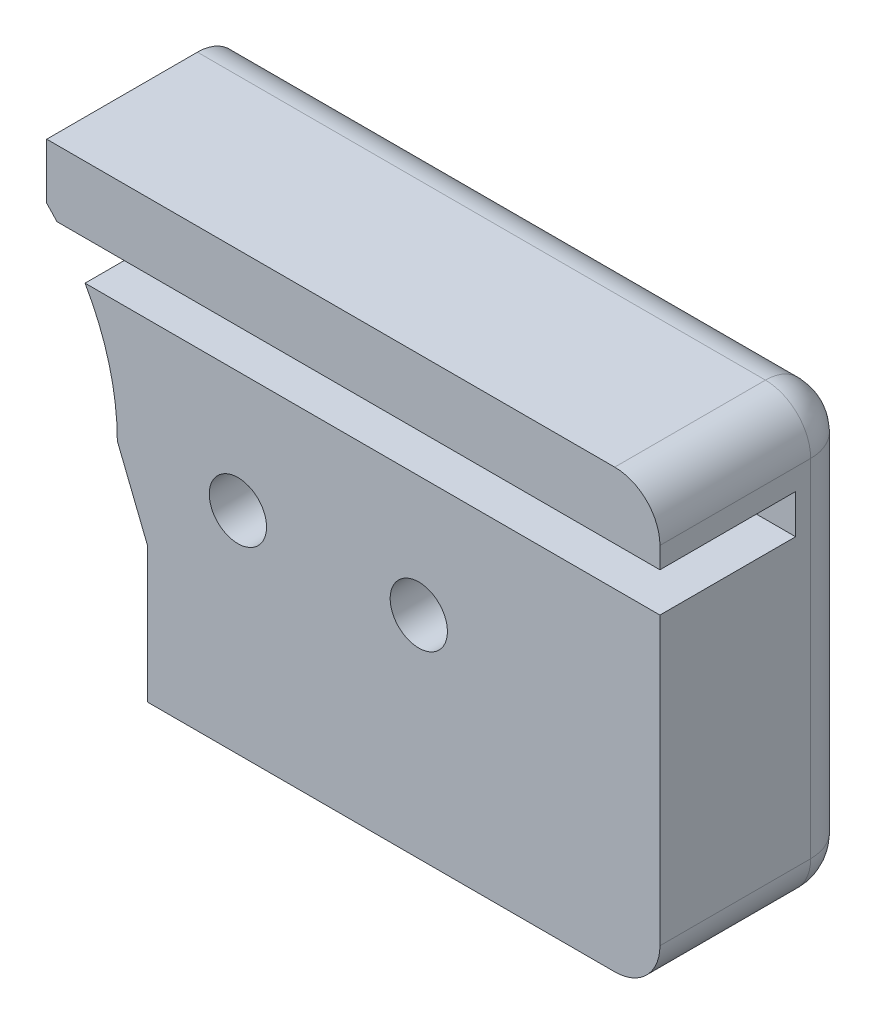
ISO-10303-21;
HEADER;
FILE_DESCRIPTION(('STEP AP214'),'2;1');
FILE_NAME('part.step','',(''),(''),'','','');
FILE_SCHEMA(('AUTOMOTIVE_DESIGN { 1 0 10303 214 1 1 1 1 }'));
ENDSEC;
DATA;
#1=APPLICATION_CONTEXT('core data for automotive mechanical design processes');
#2=APPLICATION_PROTOCOL_DEFINITION('international standard','automotive_design',2000,#1);
#3=PRODUCT_CONTEXT('',#1,'mechanical');
#4=PRODUCT('Part','Part','',(#3));
#5=PRODUCT_RELATED_PRODUCT_CATEGORY('part','',(#4));
#6=PRODUCT_DEFINITION_FORMATION('','',#4);
#7=PRODUCT_DEFINITION_CONTEXT('part definition',#1,'design');
#8=PRODUCT_DEFINITION('design','',#6,#7);
#9=PRODUCT_DEFINITION_SHAPE('','',#8);
#10=(LENGTH_UNIT() NAMED_UNIT(*) SI_UNIT(.MILLI.,.METRE.));
#11=(NAMED_UNIT(*) PLANE_ANGLE_UNIT() SI_UNIT($,.RADIAN.));
#12=(NAMED_UNIT(*) SI_UNIT($,.STERADIAN.) SOLID_ANGLE_UNIT());
#13=UNCERTAINTY_MEASURE_WITH_UNIT(LENGTH_MEASURE(1.E-05),#10,'distance_accuracy_value','');
#14=(GEOMETRIC_REPRESENTATION_CONTEXT(3) GLOBAL_UNCERTAINTY_ASSIGNED_CONTEXT((#13)) GLOBAL_UNIT_ASSIGNED_CONTEXT((#10,
#11,#12)) REPRESENTATION_CONTEXT('',''));
#15=CARTESIAN_POINT('',(0.,0.,0.));
#16=DIRECTION('',(0.,0.,1.));
#17=DIRECTION('',(1.,0.,0.));
#18=AXIS2_PLACEMENT_3D('',#15,#16,#17);
#19=CARTESIAN_POINT('',(0.,0.,-11.5));
#20=DIRECTION('',(0.,0.,-1.));
#21=DIRECTION('',(-1.,0.,0.));
#22=AXIS2_PLACEMENT_3D('',#19,#20,#21);
#23=PLANE('',#22);
#24=CARTESIAN_POINT('',(12.,0.,-11.5));
#25=DIRECTION('',(0.,0.,-1.));
#26=DIRECTION('',(-1.,0.,0.));
#27=AXIS2_PLACEMENT_3D('',#24,#25,#26);
#28=CIRCLE('',#27,0.949999999999999);
#29=CARTESIAN_POINT('',(11.05,0.,-11.5));
#30=VERTEX_POINT('',#29);
#31=EDGE_CURVE('E303',#30,#30,#28,.F.);
#32=ORIENTED_EDGE('',*,*,#31,.F.);
#33=EDGE_LOOP('',(#32));
#34=FACE_BOUND('',#33,.T.);
#35=DIRECTION('',(0.,1.,0.));
#36=VECTOR('',#35,1.);
#37=CARTESIAN_POINT('',(9.00000000000001,-7.00163526528755,-11.5));
#38=LINE('',#37,#36);
#39=CARTESIAN_POINT('',(9.00000000000001,-7.00163526528755,-11.5));
#40=VERTEX_POINT('',#39);
#41=CARTESIAN_POINT('',(9.00000000000001,-2.50163526528762,-11.5));
#42=VERTEX_POINT('',#41);
#43=EDGE_CURVE('E215',#40,#42,#38,.T.);
#44=ORIENTED_EDGE('',*,*,#43,.F.);
#45=DIRECTION('',(-1.,0.,0.));
#46=VECTOR('',#45,1.);
#47=CARTESIAN_POINT('',(26.,-7.00163526528755,-11.5));
#48=LINE('',#47,#46);
#49=CARTESIAN_POINT('',(24.5,-7.00163526528755,-11.5));
#50=VERTEX_POINT('',#49);
#51=EDGE_CURVE('E297',#50,#40,#48,.T.);
#52=ORIENTED_EDGE('',*,*,#51,.F.);
#53=CARTESIAN_POINT('',(24.5,-5.50163526528755,-11.5));
#54=DIRECTION('',(0.,0.,-1.));
#55=DIRECTION('',(-1.,0.,0.));
#56=AXIS2_PLACEMENT_3D('',#53,#54,#55);
#57=CIRCLE('',#56,1.5);
#58=CARTESIAN_POINT('',(26.,-5.50163526528755,-11.5));
#59=VERTEX_POINT('',#58);
#60=EDGE_CURVE('E294',#50,#59,#57,.F.);
#61=ORIENTED_EDGE('',*,*,#60,.T.);
#62=DIRECTION('',(0.,-1.,0.));
#63=VECTOR('',#62,1.);
#64=CARTESIAN_POINT('',(26.,-7.00163526528755,-11.5));
#65=LINE('',#64,#63);
#66=CARTESIAN_POINT('',(26.,3.99836473471238,-11.5));
#67=VERTEX_POINT('',#66);
#68=EDGE_CURVE('E291',#67,#59,#65,.T.);
#69=ORIENTED_EDGE('',*,*,#68,.F.);
#70=DIRECTION('',(-1.,0.,0.));
#71=VECTOR('',#70,1.);
#72=CARTESIAN_POINT('',(0.,3.99836473471238,-11.5));
#73=LINE('',#72,#71);
#74=CARTESIAN_POINT('',(6.9291470938499,3.99836473471238,-11.5));
#75=VERTEX_POINT('',#74);
#76=EDGE_CURVE('E12',#67,#75,#73,.T.);
#77=ORIENTED_EDGE('',*,*,#76,.T.);
#78=CARTESIAN_POINT('',(0.,0.,-11.5));
#79=DIRECTION('',(0.,0.,1.));
#80=DIRECTION('',(-1.,0.,0.));
#81=AXIS2_PLACEMENT_3D('',#78,#79,#80);
#82=CIRCLE('',#81,8.00000000000001);
#83=CARTESIAN_POINT('',(8.00000000000001,0.,-11.5));
#84=VERTEX_POINT('',#83);
#85=EDGE_CURVE('E165',#84,#75,#82,.T.);
#86=ORIENTED_EDGE('',*,*,#85,.F.);
#87=DIRECTION('',(-0.371181363469624,0.92856038867315,0.));
#88=VECTOR('',#87,1.);
#89=CARTESIAN_POINT('',(8.00000000000001,0.,-11.5));
#90=LINE('',#89,#88);
#91=EDGE_CURVE('E166',#42,#84,#90,.T.);
#92=ORIENTED_EDGE('',*,*,#91,.F.);
#93=EDGE_LOOP('',(#44,#52,#61,#69,#77,#86,#92));
#94=FACE_BOUND('',#93,.T.);
#95=CARTESIAN_POINT('',(18.,0.,-11.5));
#96=DIRECTION('',(0.,0.,-1.));
#97=DIRECTION('',(-1.,0.,0.));
#98=AXIS2_PLACEMENT_3D('',#95,#96,#97);
#99=CIRCLE('',#98,0.950000000000001);
#100=CARTESIAN_POINT('',(17.05,0.,-11.5));
#101=VERTEX_POINT('',#100);
#102=EDGE_CURVE('E46',#101,#101,#99,.F.);
#103=ORIENTED_EDGE('',*,*,#102,.F.);
#104=EDGE_LOOP('',(#103));
#105=FACE_BOUND('',#104,.T.);
#106=ADVANCED_FACE('F43',(#34,#94,#105),#23,.F.);
#107=CARTESIAN_POINT('',(24.5,5.99836473471239,-11.5));
#108=DIRECTION('',(0.,0.,-1.));
#109=DIRECTION('',(-1.,0.,0.));
#110=AXIS2_PLACEMENT_3D('',#107,#108,#109);
#111=CIRCLE('',#110,1.5);
#112=CARTESIAN_POINT('',(26.,5.99836473471239,-11.5));
#113=VERTEX_POINT('',#112);
#114=CARTESIAN_POINT('',(24.5,7.49836473471239,-11.5));
#115=VERTEX_POINT('',#114);
#116=EDGE_CURVE('E201',#113,#115,#111,.F.);
#117=ORIENTED_EDGE('',*,*,#116,.T.);
#118=DIRECTION('',(1.,0.,0.));
#119=VECTOR('',#118,1.);
#120=CARTESIAN_POINT('',(5.65685424949238,7.49836473471238,-11.5));
#121=LINE('',#120,#119);
#122=CARTESIAN_POINT('',(5.65685424949238,7.49836473471238,-11.5));
#123=VERTEX_POINT('',#122);
#124=EDGE_CURVE('E172',#123,#115,#121,.T.);
#125=ORIENTED_EDGE('',*,*,#124,.F.);
#126=DIRECTION('',(0.,1.,0.));
#127=VECTOR('',#126,1.);
#128=CARTESIAN_POINT('',(5.65685424949238,5.65685424949239,-11.5));
#129=LINE('',#128,#127);
#130=CARTESIAN_POINT('',(5.65685424949238,5.65685424949239,-11.5));
#131=VERTEX_POINT('',#130);
#132=EDGE_CURVE('E169',#131,#123,#129,.T.);
#133=ORIENTED_EDGE('',*,*,#132,.F.);
#134=CARTESIAN_POINT('',(5.99394120241067,5.29836473471238,-11.5));
#135=VERTEX_POINT('',#134);
#136=EDGE_CURVE('E154',#135,#131,#82,.T.);
#137=ORIENTED_EDGE('',*,*,#136,.F.);
#138=DIRECTION('',(1.,0.,0.));
#139=VECTOR('',#138,1.);
#140=CARTESIAN_POINT('',(0.,5.29836473471238,-11.5));
#141=LINE('',#140,#139);
#142=CARTESIAN_POINT('',(26.,5.29836473471238,-11.5));
#143=VERTEX_POINT('',#142);
#144=EDGE_CURVE('E52',#135,#143,#141,.T.);
#145=ORIENTED_EDGE('',*,*,#144,.T.);
#146=EDGE_CURVE('E66',#113,#143,#65,.T.);
#147=ORIENTED_EDGE('',*,*,#146,.F.);
#148=EDGE_LOOP('',(#117,#125,#133,#137,#145,#147));
#149=FACE_BOUND('',#148,.T.);
#150=ADVANCED_FACE('F171',(#149),#23,.F.);
#151=CARTESIAN_POINT('',(18.,0.,1.2));
#152=DIRECTION('',(0.,0.,-1.));
#153=DIRECTION('',(-1.,0.,0.));
#154=AXIS2_PLACEMENT_3D('',#151,#152,#153);
#155=CYLINDRICAL_SURFACE('',#154,0.950000000000001);
#156=ORIENTED_EDGE('',*,*,#102,.T.);
#157=EDGE_LOOP('',(#156));
#158=FACE_BOUND('',#157,.T.);
#159=CARTESIAN_POINT('',(18.,0.,-13.5));
#160=DIRECTION('',(0.,0.,1.));
#161=DIRECTION('',(1.,0.,0.));
#162=AXIS2_PLACEMENT_3D('',#159,#160,#161);
#163=CIRCLE('',#162,0.950000000000001);
#164=CARTESIAN_POINT('',(18.95,0.,-13.5));
#165=VERTEX_POINT('',#164);
#166=EDGE_CURVE('E210',#165,#165,#163,.F.);
#167=ORIENTED_EDGE('',*,*,#166,.T.);
#168=EDGE_LOOP('',(#167));
#169=FACE_BOUND('',#168,.T.);
#170=ADVANCED_FACE('F312',(#158,#169),#155,.F.);
#171=CARTESIAN_POINT('',(12.,0.,1.2));
#172=DIRECTION('',(0.,0.,-1.));
#173=DIRECTION('',(-1.,0.,0.));
#174=AXIS2_PLACEMENT_3D('',#171,#172,#173);
#175=CYLINDRICAL_SURFACE('',#174,0.949999999999999);
#176=ORIENTED_EDGE('',*,*,#31,.T.);
#177=EDGE_LOOP('',(#176));
#178=FACE_BOUND('',#177,.T.);
#179=CARTESIAN_POINT('',(12.,0.,-13.5));
#180=DIRECTION('',(0.,0.,1.));
#181=DIRECTION('',(1.,0.,0.));
#182=AXIS2_PLACEMENT_3D('',#179,#180,#181);
#183=CIRCLE('',#182,0.949999999999999);
#184=CARTESIAN_POINT('',(12.95,0.,-13.5));
#185=VERTEX_POINT('',#184);
#186=EDGE_CURVE('E206',#185,#185,#183,.F.);
#187=ORIENTED_EDGE('',*,*,#186,.T.);
#188=EDGE_LOOP('',(#187));
#189=FACE_BOUND('',#188,.T.);
#190=ADVANCED_FACE('F415',(#178,#189),#175,.F.);
#191=CARTESIAN_POINT('',(9.00000000000001,-7.00163526528755,2.));
#192=DIRECTION('',(1.,0.,0.));
#193=DIRECTION('',(0.,0.,-1.));
#194=AXIS2_PLACEMENT_3D('',#191,#192,#193);
#195=PLANE('',#194);
#196=DIRECTION('',(0.,0.,-1.));
#197=VECTOR('',#196,1.);
#198=CARTESIAN_POINT('',(9.00000000000001,-7.00163526528755,2.));
#199=LINE('',#198,#197);
#200=CARTESIAN_POINT('',(9.00000000000001,-7.00163526528755,-16.5));
#201=VERTEX_POINT('',#200);
#202=EDGE_CURVE('E277',#40,#201,#199,.T.);
#203=ORIENTED_EDGE('',*,*,#202,.F.);
#204=ORIENTED_EDGE('',*,*,#43,.T.);
#205=DIRECTION('',(0.,0.,1.));
#206=VECTOR('',#205,1.);
#207=CARTESIAN_POINT('',(9.00000000000001,-2.50163526528762,-18.));
#208=LINE('',#207,#206);
#209=CARTESIAN_POINT('',(9.00000000000001,-2.50163526528762,-18.));
#210=VERTEX_POINT('',#209);
#211=EDGE_CURVE('E184',#210,#42,#208,.T.);
#212=ORIENTED_EDGE('',*,*,#211,.F.);
#213=DIRECTION('',(0.,-1.,0.));
#214=VECTOR('',#213,1.);
#215=CARTESIAN_POINT('',(9.00000000000001,-7.00163526528755,-18.));
#216=LINE('',#215,#214);
#217=CARTESIAN_POINT('',(9.00000000000001,-5.50163526528755,-18.));
#218=VERTEX_POINT('',#217);
#219=EDGE_CURVE('E191',#210,#218,#216,.T.);
#220=ORIENTED_EDGE('',*,*,#219,.T.);
#221=CARTESIAN_POINT('',(9.00000000000001,-5.50163526528755,-16.5));
#222=DIRECTION('',(-1.,0.,0.));
#223=DIRECTION('',(0.,0.,1.));
#224=AXIS2_PLACEMENT_3D('',#221,#222,#223);
#225=CIRCLE('',#224,1.5);
#226=EDGE_CURVE('E238',#201,#218,#225,.F.);
#227=ORIENTED_EDGE('',*,*,#226,.F.);
#228=EDGE_LOOP('',(#203,#204,#212,#220,#227));
#229=FACE_BOUND('',#228,.T.);
#230=ADVANCED_FACE('F335',(#229),#195,.F.);
#231=CARTESIAN_POINT('',(26.,-7.00163526528755,2.));
#232=DIRECTION('',(0.,1.,0.));
#233=DIRECTION('',(-1.,0.,0.));
#234=AXIS2_PLACEMENT_3D('',#231,#232,#233);
#235=PLANE('',#234);
#236=DIRECTION('',(0.,0.,-1.));
#237=VECTOR('',#236,1.);
#238=CARTESIAN_POINT('',(24.5,-7.00163526528755,2.));
#239=LINE('',#238,#237);
#240=CARTESIAN_POINT('',(24.5,-7.00163526528755,-16.5));
#241=VERTEX_POINT('',#240);
#242=EDGE_CURVE('E283',#241,#50,#239,.F.);
#243=ORIENTED_EDGE('',*,*,#242,.T.);
#244=ORIENTED_EDGE('',*,*,#51,.T.);
#245=ORIENTED_EDGE('',*,*,#202,.T.);
#246=DIRECTION('',(1.,0.,0.));
#247=VECTOR('',#246,1.);
#248=CARTESIAN_POINT('',(9.00000000000001,-7.00163526528755,-16.5));
#249=LINE('',#248,#247);
#250=EDGE_CURVE('E234',#241,#201,#249,.F.);
#251=ORIENTED_EDGE('',*,*,#250,.F.);
#252=EDGE_LOOP('',(#243,#244,#245,#251));
#253=FACE_BOUND('',#252,.T.);
#254=CARTESIAN_POINT('',(22.,-7.00163526528755,-15.));
#255=DIRECTION('',(0.,1.,0.));
#256=DIRECTION('',(1.,0.,0.));
#257=AXIS2_PLACEMENT_3D('',#254,#255,#256);
#258=CIRCLE('',#257,0.950000000000001);
#259=CARTESIAN_POINT('',(22.95,-7.00163526528755,-15.));
#260=VERTEX_POINT('',#259);
#261=EDGE_CURVE('E793',#260,#260,#258,.T.);
#262=ORIENTED_EDGE('',*,*,#261,.T.);
#263=EDGE_LOOP('',(#262));
#264=FACE_BOUND('',#263,.T.);
#265=CARTESIAN_POINT('',(18.,-7.00163526528755,-15.));
#266=DIRECTION('',(0.,1.,0.));
#267=DIRECTION('',(1.,0.,0.));
#268=AXIS2_PLACEMENT_3D('',#265,#266,#267);
#269=CIRCLE('',#268,0.950000000000001);
#270=CARTESIAN_POINT('',(18.95,-7.00163526528755,-15.));
#271=VERTEX_POINT('',#270);
#272=EDGE_CURVE('E803',#271,#271,#269,.T.);
#273=ORIENTED_EDGE('',*,*,#272,.T.);
#274=EDGE_LOOP('',(#273));
#275=FACE_BOUND('',#274,.T.);
#276=ADVANCED_FACE('F331',(#253,#264,#275),#235,.F.);
#277=CARTESIAN_POINT('',(26.,-7.00163526528755,2.));
#278=DIRECTION('',(-1.,0.,0.));
#279=DIRECTION('',(0.,0.,1.));
#280=AXIS2_PLACEMENT_3D('',#277,#278,#279);
#281=PLANE('',#280);
#282=DIRECTION('',(0.,0.,-1.));
#283=VECTOR('',#282,1.);
#284=CARTESIAN_POINT('',(26.,5.99836473471239,2.));
#285=LINE('',#284,#283);
#286=CARTESIAN_POINT('',(26.,5.99836473471239,-16.5));
#287=VERTEX_POINT('',#286);
#288=EDGE_CURVE('E280',#287,#113,#285,.F.);
#289=ORIENTED_EDGE('',*,*,#288,.T.);
#290=ORIENTED_EDGE('',*,*,#146,.T.);
#291=DIRECTION('',(0.,0.,1.));
#292=VECTOR('',#291,1.);
#293=CARTESIAN_POINT('',(26.,5.29836473471238,-18.));
#294=LINE('',#293,#292);
#295=CARTESIAN_POINT('',(26.,5.29836473471238,-16.));
#296=VERTEX_POINT('',#295);
#297=EDGE_CURVE('E364',#296,#143,#294,.T.);
#298=ORIENTED_EDGE('',*,*,#297,.F.);
#299=DIRECTION('',(0.,1.,0.));
#300=VECTOR('',#299,1.);
#301=CARTESIAN_POINT('',(26.,-7.00163526528755,-16.));
#302=LINE('',#301,#300);
#303=CARTESIAN_POINT('',(26.,3.99836473471238,-16.));
#304=VERTEX_POINT('',#303);
#305=EDGE_CURVE('E197',#304,#296,#302,.T.);
#306=ORIENTED_EDGE('',*,*,#305,.F.);
#307=DIRECTION('',(0.,0.,-1.));
#308=VECTOR('',#307,1.);
#309=CARTESIAN_POINT('',(26.,3.99836473471238,-18.));
#310=LINE('',#309,#308);
#311=EDGE_CURVE('E374',#67,#304,#310,.T.);
#312=ORIENTED_EDGE('',*,*,#311,.F.);
#313=ORIENTED_EDGE('',*,*,#68,.T.);
#314=DIRECTION('',(0.,0.,1.));
#315=VECTOR('',#314,1.);
#316=CARTESIAN_POINT('',(26.,-5.50163526528755,-18.));
#317=LINE('',#316,#315);
#318=CARTESIAN_POINT('',(26.,-5.50163526528755,-16.5));
#319=VERTEX_POINT('',#318);
#320=EDGE_CURVE('E230',#319,#59,#317,.T.);
#321=ORIENTED_EDGE('',*,*,#320,.F.);
#322=DIRECTION('',(0.,1.,0.));
#323=VECTOR('',#322,1.);
#324=CARTESIAN_POINT('',(26.,-7.00163526528755,-16.5));
#325=LINE('',#324,#323);
#326=EDGE_CURVE('E226',#287,#319,#325,.F.);
#327=ORIENTED_EDGE('',*,*,#326,.F.);
#328=EDGE_LOOP('',(#289,#290,#298,#306,#312,#313,#321,#327));
#329=FACE_BOUND('',#328,.T.);
#330=ADVANCED_FACE('F348',(#329),#281,.F.);
#331=CARTESIAN_POINT('',(5.65685424949238,7.49836473471238,2.));
#332=DIRECTION('',(0.,-1.,0.));
#333=DIRECTION('',(1.,0.,0.));
#334=AXIS2_PLACEMENT_3D('',#331,#332,#333);
#335=PLANE('',#334);
#336=DIRECTION('',(0.,0.,-1.));
#337=VECTOR('',#336,1.);
#338=CARTESIAN_POINT('',(5.65685424949238,7.49836473471238,2.));
#339=LINE('',#338,#337);
#340=CARTESIAN_POINT('',(5.65685424949238,7.49836473471238,-16.5));
#341=VERTEX_POINT('',#340);
#342=EDGE_CURVE('E250',#123,#341,#339,.T.);
#343=ORIENTED_EDGE('',*,*,#342,.F.);
#344=ORIENTED_EDGE('',*,*,#124,.T.);
#345=DIRECTION('',(0.,0.,-1.));
#346=VECTOR('',#345,1.);
#347=CARTESIAN_POINT('',(24.5,7.49836473471239,2.));
#348=LINE('',#347,#346);
#349=CARTESIAN_POINT('',(24.5,7.49836473471239,-16.5));
#350=VERTEX_POINT('',#349);
#351=EDGE_CURVE('E176',#115,#350,#348,.T.);
#352=ORIENTED_EDGE('',*,*,#351,.T.);
#353=DIRECTION('',(-1.,0.,0.));
#354=VECTOR('',#353,1.);
#355=CARTESIAN_POINT('',(26.,7.49836473471239,-16.5));
#356=LINE('',#355,#354);
#357=EDGE_CURVE('E246',#341,#350,#356,.F.);
#358=ORIENTED_EDGE('',*,*,#357,.F.);
#359=EDGE_LOOP('',(#343,#344,#352,#358));
#360=FACE_BOUND('',#359,.T.);
#361=ADVANCED_FACE('F400',(#360),#335,.F.);
#362=CARTESIAN_POINT('',(5.65685424949238,5.65685424949239,2.));
#363=DIRECTION('',(1.,0.,0.));
#364=DIRECTION('',(0.,0.,-1.));
#365=AXIS2_PLACEMENT_3D('',#362,#363,#364);
#366=PLANE('',#365);
#367=DIRECTION('',(0.,0.,1.));
#368=VECTOR('',#367,1.);
#369=CARTESIAN_POINT('',(5.65685424949238,5.65685424949239,-18.));
#370=LINE('',#369,#368);
#371=CARTESIAN_POINT('',(5.65685424949238,5.65685424949239,-18.));
#372=VERTEX_POINT('',#371);
#373=EDGE_CURVE('E159',#372,#131,#370,.T.);
#374=ORIENTED_EDGE('',*,*,#373,.T.);
#375=ORIENTED_EDGE('',*,*,#132,.T.);
#376=ORIENTED_EDGE('',*,*,#342,.T.);
#377=CARTESIAN_POINT('',(5.65685424949238,5.99836473471239,-16.5));
#378=DIRECTION('',(-1.,0.,0.));
#379=DIRECTION('',(0.,0.,1.));
#380=AXIS2_PLACEMENT_3D('',#377,#378,#379);
#381=CIRCLE('',#380,1.5);
#382=CARTESIAN_POINT('',(5.65685424949238,5.99836473471239,-18.));
#383=VERTEX_POINT('',#382);
#384=EDGE_CURVE('E242',#383,#341,#381,.F.);
#385=ORIENTED_EDGE('',*,*,#384,.F.);
#386=DIRECTION('',(0.,-1.,0.));
#387=VECTOR('',#386,1.);
#388=CARTESIAN_POINT('',(5.65685424949238,5.65685424949239,-18.));
#389=LINE('',#388,#387);
#390=EDGE_CURVE('E181',#383,#372,#389,.T.);
#391=ORIENTED_EDGE('',*,*,#390,.T.);
#392=EDGE_LOOP('',(#374,#375,#376,#385,#391));
#393=FACE_BOUND('',#392,.T.);
#394=ADVANCED_FACE('F178',(#393),#366,.F.);
#395=CARTESIAN_POINT('',(24.5,-5.50163526528755,2.));
#396=DIRECTION('',(0.,0.,-1.));
#397=DIRECTION('',(-1.,0.,0.));
#398=AXIS2_PLACEMENT_3D('',#395,#396,#397);
#399=CYLINDRICAL_SURFACE('',#398,1.5);
#400=ORIENTED_EDGE('',*,*,#60,.F.);
#401=ORIENTED_EDGE('',*,*,#242,.F.);
#402=CARTESIAN_POINT('',(24.5,-5.50163526528755,-16.5));
#403=DIRECTION('',(0.,0.,1.));
#404=DIRECTION('',(1.,0.,0.));
#405=AXIS2_PLACEMENT_3D('',#402,#403,#404);
#406=CIRCLE('',#405,1.5);
#407=EDGE_CURVE('E270',#241,#319,#406,.T.);
#408=ORIENTED_EDGE('',*,*,#407,.T.);
#409=ORIENTED_EDGE('',*,*,#320,.T.);
#410=EDGE_LOOP('',(#400,#401,#408,#409));
#411=FACE_BOUND('',#410,.T.);
#412=ADVANCED_FACE('F346',(#411),#399,.T.);
#413=CARTESIAN_POINT('',(24.5,5.99836473471239,2.));
#414=DIRECTION('',(0.,0.,-1.));
#415=DIRECTION('',(-1.,0.,0.));
#416=AXIS2_PLACEMENT_3D('',#413,#414,#415);
#417=CYLINDRICAL_SURFACE('',#416,1.5);
#418=ORIENTED_EDGE('',*,*,#116,.F.);
#419=ORIENTED_EDGE('',*,*,#288,.F.);
#420=CARTESIAN_POINT('',(24.5,5.99836473471239,-16.5));
#421=DIRECTION('',(0.,0.,1.));
#422=DIRECTION('',(1.,0.,0.));
#423=AXIS2_PLACEMENT_3D('',#420,#421,#422);
#424=CIRCLE('',#423,1.5);
#425=EDGE_CURVE('E258',#287,#350,#424,.T.);
#426=ORIENTED_EDGE('',*,*,#425,.T.);
#427=ORIENTED_EDGE('',*,*,#351,.F.);
#428=EDGE_LOOP('',(#418,#419,#426,#427));
#429=FACE_BOUND('',#428,.T.);
#430=ADVANCED_FACE('F361',(#429),#417,.T.);
#431=CARTESIAN_POINT('',(0.,0.,-18.));
#432=DIRECTION('',(0.,0.,1.));
#433=DIRECTION('',(-1.,0.,0.));
#434=AXIS2_PLACEMENT_3D('',#431,#432,#433);
#435=CYLINDRICAL_SURFACE('',#434,8.00000000000001);
#436=ORIENTED_EDGE('',*,*,#136,.T.);
#437=ORIENTED_EDGE('',*,*,#373,.F.);
#438=CARTESIAN_POINT('',(0.,0.,-18.));
#439=DIRECTION('',(0.,0.,-1.));
#440=DIRECTION('',(1.,0.,0.));
#441=AXIS2_PLACEMENT_3D('',#438,#439,#440);
#442=CIRCLE('',#441,8.00000000000001);
#443=CARTESIAN_POINT('',(8.00000000000001,0.,-18.));
#444=VERTEX_POINT('',#443);
#445=EDGE_CURVE('E384',#372,#444,#442,.T.);
#446=ORIENTED_EDGE('',*,*,#445,.T.);
#447=DIRECTION('',(0.,0.,1.));
#448=VECTOR('',#447,1.);
#449=CARTESIAN_POINT('',(8.00000000000001,0.,-18.));
#450=LINE('',#449,#448);
#451=EDGE_CURVE('E189',#444,#84,#450,.T.);
#452=ORIENTED_EDGE('',*,*,#451,.T.);
#453=ORIENTED_EDGE('',*,*,#85,.T.);
#454=DIRECTION('',(0.,0.,1.));
#455=VECTOR('',#454,1.);
#456=CARTESIAN_POINT('',(6.9291470938499,3.99836473471238,-18.));
#457=LINE('',#456,#455);
#458=CARTESIAN_POINT('',(6.9291470938499,3.99836473471238,-16.));
#459=VERTEX_POINT('',#458);
#460=EDGE_CURVE('E368',#459,#75,#457,.T.);
#461=ORIENTED_EDGE('',*,*,#460,.F.);
#462=CARTESIAN_POINT('',(0.,0.,-16.));
#463=DIRECTION('',(0.,0.,1.));
#464=DIRECTION('',(1.,0.,0.));
#465=AXIS2_PLACEMENT_3D('',#462,#463,#464);
#466=CIRCLE('',#465,8.00000000000001);
#467=CARTESIAN_POINT('',(5.99394120241067,5.29836473471238,-16.));
#468=VERTEX_POINT('',#467);
#469=EDGE_CURVE('E372',#468,#459,#466,.F.);
#470=ORIENTED_EDGE('',*,*,#469,.F.);
#471=DIRECTION('',(0.,0.,1.));
#472=VECTOR('',#471,1.);
#473=CARTESIAN_POINT('',(5.99394120241067,5.29836473471238,-18.));
#474=LINE('',#473,#472);
#475=EDGE_CURVE('E162',#135,#468,#474,.F.);
#476=ORIENTED_EDGE('',*,*,#475,.F.);
#477=EDGE_LOOP('',(#436,#437,#446,#452,#453,#461,#470,#476));
#478=FACE_BOUND('',#477,.T.);
#479=ADVANCED_FACE('F156',(#478),#435,.F.);
#480=CARTESIAN_POINT('',(8.00000000000001,0.,-18.));
#481=DIRECTION('',(0.92856038867315,0.371181363469624,0.));
#482=DIRECTION('',(-0.371181363469624,0.92856038867315,0.));
#483=AXIS2_PLACEMENT_3D('',#480,#481,#482);
#484=PLANE('',#483);
#485=ORIENTED_EDGE('',*,*,#451,.F.);
#486=DIRECTION('',(0.371181363469624,-0.92856038867315,0.));
#487=VECTOR('',#486,1.);
#488=CARTESIAN_POINT('',(8.00000000000001,0.,-18.));
#489=LINE('',#488,#487);
#490=EDGE_CURVE('E387',#444,#210,#489,.T.);
#491=ORIENTED_EDGE('',*,*,#490,.T.);
#492=ORIENTED_EDGE('',*,*,#211,.T.);
#493=ORIENTED_EDGE('',*,*,#91,.T.);
#494=EDGE_LOOP('',(#485,#491,#492,#493));
#495=FACE_BOUND('',#494,.T.);
#496=ADVANCED_FACE('F393',(#495),#484,.F.);
#497=CARTESIAN_POINT('',(0.,0.,-18.));
#498=DIRECTION('',(0.,0.,-1.));
#499=DIRECTION('',(1.,0.,0.));
#500=AXIS2_PLACEMENT_3D('',#497,#498,#499);
#501=PLANE('',#500);
#502=CARTESIAN_POINT('',(12.,0.,-18.));
#503=DIRECTION('',(0.,0.,1.));
#504=DIRECTION('',(1.,0.,0.));
#505=AXIS2_PLACEMENT_3D('',#502,#503,#504);
#506=CIRCLE('',#505,2.);
#507=CARTESIAN_POINT('',(14.,0.,-18.));
#508=VERTEX_POINT('',#507);
#509=EDGE_CURVE('E810',#508,#508,#506,.T.);
#510=ORIENTED_EDGE('',*,*,#509,.T.);
#511=EDGE_LOOP('',(#510));
#512=FACE_BOUND('',#511,.T.);
#513=CARTESIAN_POINT('',(18.,0.,-18.));
#514=DIRECTION('',(0.,0.,1.));
#515=DIRECTION('',(1.,0.,0.));
#516=AXIS2_PLACEMENT_3D('',#513,#514,#515);
#517=CIRCLE('',#516,2.);
#518=CARTESIAN_POINT('',(20.,0.,-18.));
#519=VERTEX_POINT('',#518);
#520=EDGE_CURVE('E274',#519,#519,#517,.T.);
#521=ORIENTED_EDGE('',*,*,#520,.T.);
#522=EDGE_LOOP('',(#521));
#523=FACE_BOUND('',#522,.T.);
#524=ORIENTED_EDGE('',*,*,#219,.F.);
#525=ORIENTED_EDGE('',*,*,#490,.F.);
#526=ORIENTED_EDGE('',*,*,#445,.F.);
#527=ORIENTED_EDGE('',*,*,#390,.F.);
#528=DIRECTION('',(-1.,0.,0.));
#529=VECTOR('',#528,1.);
#530=CARTESIAN_POINT('',(5.65685424949238,5.99836473471239,-18.));
#531=LINE('',#530,#529);
#532=CARTESIAN_POINT('',(24.5,5.99836473471239,-18.));
#533=VERTEX_POINT('',#532);
#534=EDGE_CURVE('E205',#533,#383,#531,.T.);
#535=ORIENTED_EDGE('',*,*,#534,.F.);
#536=DIRECTION('',(0.,1.,0.));
#537=VECTOR('',#536,1.);
#538=CARTESIAN_POINT('',(24.5,7.49836473471239,-18.));
#539=LINE('',#538,#537);
#540=CARTESIAN_POINT('',(24.5,-5.50163526528755,-18.));
#541=VERTEX_POINT('',#540);
#542=EDGE_CURVE('E218',#541,#533,#539,.T.);
#543=ORIENTED_EDGE('',*,*,#542,.F.);
#544=DIRECTION('',(1.,0.,0.));
#545=VECTOR('',#544,1.);
#546=CARTESIAN_POINT('',(26.,-5.50163526528755,-18.));
#547=LINE('',#546,#545);
#548=EDGE_CURVE('E222',#218,#541,#547,.T.);
#549=ORIENTED_EDGE('',*,*,#548,.F.);
#550=EDGE_LOOP('',(#524,#525,#526,#527,#535,#543,#549));
#551=FACE_BOUND('',#550,.T.);
#552=ADVANCED_FACE('F395',(#512,#523,#551),#501,.T.);
#553=CARTESIAN_POINT('',(0.,0.,-16.));
#554=DIRECTION('',(0.,0.,-1.));
#555=DIRECTION('',(1.,0.,0.));
#556=AXIS2_PLACEMENT_3D('',#553,#554,#555);
#557=PLANE('',#556);
#558=DIRECTION('',(1.,0.,0.));
#559=VECTOR('',#558,1.);
#560=CARTESIAN_POINT('',(29.8495351115723,5.29836473471238,-16.));
#561=LINE('',#560,#559);
#562=EDGE_CURVE('E328',#468,#296,#561,.T.);
#563=ORIENTED_EDGE('',*,*,#562,.F.);
#564=ORIENTED_EDGE('',*,*,#469,.T.);
#565=DIRECTION('',(-1.,0.,0.));
#566=VECTOR('',#565,1.);
#567=CARTESIAN_POINT('',(2.73814114815064,3.99836473471238,-16.));
#568=LINE('',#567,#566);
#569=EDGE_CURVE('E823',#304,#459,#568,.T.);
#570=ORIENTED_EDGE('',*,*,#569,.F.);
#571=ORIENTED_EDGE('',*,*,#305,.T.);
#572=EDGE_LOOP('',(#563,#564,#570,#571));
#573=FACE_BOUND('',#572,.T.);
#574=ADVANCED_FACE('F445',(#573),#557,.F.);
#575=CARTESIAN_POINT('',(26.,5.29836473471238,-16.));
#576=DIRECTION('',(0.,1.,0.));
#577=DIRECTION('',(0.,0.,-1.));
#578=AXIS2_PLACEMENT_3D('',#575,#576,#577);
#579=PLANE('',#578);
#580=ORIENTED_EDGE('',*,*,#144,.F.);
#581=ORIENTED_EDGE('',*,*,#475,.T.);
#582=ORIENTED_EDGE('',*,*,#562,.T.);
#583=ORIENTED_EDGE('',*,*,#297,.T.);
#584=EDGE_LOOP('',(#580,#581,#582,#583));
#585=FACE_BOUND('',#584,.T.);
#586=ADVANCED_FACE('F365',(#585),#579,.F.);
#587=CARTESIAN_POINT('',(2.73814114815064,3.99836473471238,-16.));
#588=DIRECTION('',(0.,-1.,0.));
#589=DIRECTION('',(1.,0.,0.));
#590=AXIS2_PLACEMENT_3D('',#587,#588,#589);
#591=PLANE('',#590);
#592=ORIENTED_EDGE('',*,*,#569,.T.);
#593=ORIENTED_EDGE('',*,*,#460,.T.);
#594=ORIENTED_EDGE('',*,*,#76,.F.);
#595=ORIENTED_EDGE('',*,*,#311,.T.);
#596=EDGE_LOOP('',(#592,#593,#594,#595));
#597=FACE_BOUND('',#596,.T.);
#598=ADVANCED_FACE('F461',(#597),#591,.F.);
#599=CARTESIAN_POINT('',(12.,0.,-13.5));
#600=DIRECTION('',(0.,0.,-1.));
#601=DIRECTION('',(1.,0.,0.));
#602=AXIS2_PLACEMENT_3D('',#599,#600,#601);
#603=PLANE('',#602);
#604=CARTESIAN_POINT('',(12.,0.,-13.5));
#605=DIRECTION('',(0.,0.,1.));
#606=DIRECTION('',(1.,0.,0.));
#607=AXIS2_PLACEMENT_3D('',#604,#605,#606);
#608=CIRCLE('',#607,2.);
#609=CARTESIAN_POINT('',(14.,0.,-13.5));
#610=VERTEX_POINT('',#609);
#611=EDGE_CURVE('E211',#610,#610,#608,.T.);
#612=ORIENTED_EDGE('',*,*,#611,.F.);
#613=EDGE_LOOP('',(#612));
#614=FACE_BOUND('',#613,.T.);
#615=ORIENTED_EDGE('',*,*,#186,.F.);
#616=EDGE_LOOP('',(#615));
#617=FACE_BOUND('',#616,.T.);
#618=ADVANCED_FACE('F468',(#614,#617),#603,.T.);
#619=CARTESIAN_POINT('',(12.,0.,-13.5));
#620=DIRECTION('',(0.,0.,-1.));
#621=DIRECTION('',(1.,0.,0.));
#622=AXIS2_PLACEMENT_3D('',#619,#620,#621);
#623=CYLINDRICAL_SURFACE('',#622,2.);
#624=ORIENTED_EDGE('',*,*,#611,.T.);
#625=EDGE_LOOP('',(#624));
#626=FACE_BOUND('',#625,.T.);
#627=ORIENTED_EDGE('',*,*,#509,.F.);
#628=EDGE_LOOP('',(#627));
#629=FACE_BOUND('',#628,.T.);
#630=ADVANCED_FACE('F475',(#626,#629),#623,.F.);
#631=CARTESIAN_POINT('',(18.,0.,-13.5));
#632=DIRECTION('',(0.,0.,-1.));
#633=DIRECTION('',(1.,0.,0.));
#634=AXIS2_PLACEMENT_3D('',#631,#632,#633);
#635=PLANE('',#634);
#636=CARTESIAN_POINT('',(18.,0.,-13.5));
#637=DIRECTION('',(0.,0.,1.));
#638=DIRECTION('',(1.,0.,0.));
#639=AXIS2_PLACEMENT_3D('',#636,#637,#638);
#640=CIRCLE('',#639,2.);
#641=CARTESIAN_POINT('',(20.,0.,-13.5));
#642=VERTEX_POINT('',#641);
#643=EDGE_CURVE('E814',#642,#642,#640,.T.);
#644=ORIENTED_EDGE('',*,*,#643,.F.);
#645=EDGE_LOOP('',(#644));
#646=FACE_BOUND('',#645,.T.);
#647=ORIENTED_EDGE('',*,*,#166,.F.);
#648=EDGE_LOOP('',(#647));
#649=FACE_BOUND('',#648,.T.);
#650=ADVANCED_FACE('F484',(#646,#649),#635,.T.);
#651=CARTESIAN_POINT('',(18.,0.,-13.5));
#652=DIRECTION('',(0.,0.,-1.));
#653=DIRECTION('',(1.,0.,0.));
#654=AXIS2_PLACEMENT_3D('',#651,#652,#653);
#655=CYLINDRICAL_SURFACE('',#654,2.);
#656=ORIENTED_EDGE('',*,*,#643,.T.);
#657=EDGE_LOOP('',(#656));
#658=FACE_BOUND('',#657,.T.);
#659=ORIENTED_EDGE('',*,*,#520,.F.);
#660=EDGE_LOOP('',(#659));
#661=FACE_BOUND('',#660,.T.);
#662=ADVANCED_FACE('F492',(#658,#661),#655,.F.);
#663=CARTESIAN_POINT('',(0.,-5.50163526528755,-16.5));
#664=DIRECTION('',(-1.,0.,0.));
#665=DIRECTION('',(0.,-1.,0.));
#666=AXIS2_PLACEMENT_3D('',#663,#664,#665);
#667=CYLINDRICAL_SURFACE('',#666,1.5);
#668=ORIENTED_EDGE('',*,*,#226,.T.);
#669=ORIENTED_EDGE('',*,*,#548,.T.);
#670=CARTESIAN_POINT('',(24.5,-5.50163526528755,-16.5));
#671=DIRECTION('',(-1.,0.,0.));
#672=DIRECTION('',(0.,0.,1.));
#673=AXIS2_PLACEMENT_3D('',#670,#671,#672);
#674=CIRCLE('',#673,1.5);
#675=EDGE_CURVE('E266',#541,#241,#674,.T.);
#676=ORIENTED_EDGE('',*,*,#675,.T.);
#677=ORIENTED_EDGE('',*,*,#250,.T.);
#678=EDGE_LOOP('',(#668,#669,#676,#677));
#679=FACE_BOUND('',#678,.T.);
#680=ADVANCED_FACE('F338',(#679),#667,.T.);
#681=CARTESIAN_POINT('',(0.,5.99836473471238,-16.5));
#682=DIRECTION('',(1.,0.,0.));
#683=DIRECTION('',(0.,1.,0.));
#684=AXIS2_PLACEMENT_3D('',#681,#682,#683);
#685=CYLINDRICAL_SURFACE('',#684,1.5);
#686=ORIENTED_EDGE('',*,*,#384,.T.);
#687=ORIENTED_EDGE('',*,*,#357,.T.);
#688=CARTESIAN_POINT('',(24.5,5.99836473471239,-16.5));
#689=DIRECTION('',(-1.,0.,0.));
#690=DIRECTION('',(0.,0.,1.));
#691=AXIS2_PLACEMENT_3D('',#688,#689,#690);
#692=CIRCLE('',#691,1.5);
#693=EDGE_CURVE('E262',#350,#533,#692,.T.);
#694=ORIENTED_EDGE('',*,*,#693,.T.);
#695=ORIENTED_EDGE('',*,*,#534,.T.);
#696=EDGE_LOOP('',(#686,#687,#694,#695));
#697=FACE_BOUND('',#696,.T.);
#698=ADVANCED_FACE('F397',(#697),#685,.T.);
#699=CARTESIAN_POINT('',(24.5,-5.50163526528755,-16.5));
#700=DIRECTION('',(0.,0.,-1.));
#701=DIRECTION('',(1.,0.,0.));
#702=AXIS2_PLACEMENT_3D('',#699,#700,#701);
#703=SPHERICAL_SURFACE('',#702,1.5);
#704=ORIENTED_EDGE('',*,*,#675,.F.);
#705=CARTESIAN_POINT('',(24.5,-5.50163526528755,-16.5));
#706=DIRECTION('',(0.,1.,0.));
#707=DIRECTION('',(0.,0.,1.));
#708=AXIS2_PLACEMENT_3D('',#705,#706,#707);
#709=CIRCLE('',#708,1.5);
#710=EDGE_CURVE('E254',#541,#319,#709,.F.);
#711=ORIENTED_EDGE('',*,*,#710,.T.);
#712=ORIENTED_EDGE('',*,*,#407,.F.);
#713=EDGE_LOOP('',(#704,#711,#712));
#714=FACE_BOUND('',#713,.T.);
#715=ADVANCED_FACE('F343',(#714),#703,.T.);
#716=CARTESIAN_POINT('',(24.5,5.99836473471239,-16.5));
#717=DIRECTION('',(0.,0.,-1.));
#718=DIRECTION('',(1.,0.,0.));
#719=AXIS2_PLACEMENT_3D('',#716,#717,#718);
#720=SPHERICAL_SURFACE('',#719,1.5);
#721=ORIENTED_EDGE('',*,*,#425,.F.);
#722=CARTESIAN_POINT('',(24.5,5.99836473471239,-16.5));
#723=DIRECTION('',(0.,-1.,0.));
#724=DIRECTION('',(0.,0.,-1.));
#725=AXIS2_PLACEMENT_3D('',#722,#723,#724);
#726=CIRCLE('',#725,1.5);
#727=EDGE_CURVE('E251',#287,#533,#726,.F.);
#728=ORIENTED_EDGE('',*,*,#727,.T.);
#729=ORIENTED_EDGE('',*,*,#693,.F.);
#730=EDGE_LOOP('',(#721,#728,#729));
#731=FACE_BOUND('',#730,.T.);
#732=ADVANCED_FACE('F357',(#731),#720,.T.);
#733=CARTESIAN_POINT('',(24.5,0.,-16.5));
#734=DIRECTION('',(0.,-1.,0.));
#735=DIRECTION('',(0.,0.,1.));
#736=AXIS2_PLACEMENT_3D('',#733,#734,#735);
#737=CYLINDRICAL_SURFACE('',#736,1.5);
#738=ORIENTED_EDGE('',*,*,#710,.F.);
#739=ORIENTED_EDGE('',*,*,#542,.T.);
#740=ORIENTED_EDGE('',*,*,#727,.F.);
#741=ORIENTED_EDGE('',*,*,#326,.T.);
#742=EDGE_LOOP('',(#738,#739,#740,#741));
#743=FACE_BOUND('',#742,.T.);
#744=ADVANCED_FACE('F352',(#743),#737,.T.);
#745=CARTESIAN_POINT('',(18.,-4.00163526528755,-15.));
#746=DIRECTION('',(0.,-1.,0.));
#747=DIRECTION('',(1.,0.,0.));
#748=AXIS2_PLACEMENT_3D('',#745,#746,#747);
#749=CYLINDRICAL_SURFACE('',#748,0.950000000000001);
#750=CARTESIAN_POINT('',(18.,-4.00163526528755,-15.));
#751=DIRECTION('',(0.,1.,0.));
#752=DIRECTION('',(1.,0.,0.));
#753=AXIS2_PLACEMENT_3D('',#750,#751,#752);
#754=CIRCLE('',#753,0.950000000000001);
#755=CARTESIAN_POINT('',(18.95,-4.00163526528755,-15.));
#756=VERTEX_POINT('',#755);
#757=EDGE_CURVE('E797',#756,#756,#754,.T.);
#758=ORIENTED_EDGE('',*,*,#757,.T.);
#759=EDGE_LOOP('',(#758));
#760=FACE_BOUND('',#759,.T.);
#761=ORIENTED_EDGE('',*,*,#272,.F.);
#762=EDGE_LOOP('',(#761));
#763=FACE_BOUND('',#762,.T.);
#764=ADVANCED_FACE('F529',(#760,#763),#749,.F.);
#765=CARTESIAN_POINT('',(18.,-4.00163526528755,-15.));
#766=DIRECTION('',(0.,-1.,0.));
#767=DIRECTION('',(1.,0.,0.));
#768=AXIS2_PLACEMENT_3D('',#765,#766,#767);
#769=PLANE('',#768);
#770=ORIENTED_EDGE('',*,*,#757,.F.);
#771=EDGE_LOOP('',(#770));
#772=FACE_BOUND('',#771,.T.);
#773=ADVANCED_FACE('F535',(#772),#769,.T.);
#774=CARTESIAN_POINT('',(22.,-4.00163526528755,-15.));
#775=DIRECTION('',(0.,-1.,0.));
#776=DIRECTION('',(1.,0.,0.));
#777=AXIS2_PLACEMENT_3D('',#774,#775,#776);
#778=CYLINDRICAL_SURFACE('',#777,0.950000000000001);
#779=CARTESIAN_POINT('',(22.,-4.00163526528755,-15.));
#780=DIRECTION('',(0.,1.,0.));
#781=DIRECTION('',(1.,0.,0.));
#782=AXIS2_PLACEMENT_3D('',#779,#780,#781);
#783=CIRCLE('',#782,0.950000000000001);
#784=CARTESIAN_POINT('',(22.95,-4.00163526528755,-15.));
#785=VERTEX_POINT('',#784);
#786=EDGE_CURVE('E255',#785,#785,#783,.T.);
#787=ORIENTED_EDGE('',*,*,#786,.T.);
#788=EDGE_LOOP('',(#787));
#789=FACE_BOUND('',#788,.T.);
#790=ORIENTED_EDGE('',*,*,#261,.F.);
#791=EDGE_LOOP('',(#790));
#792=FACE_BOUND('',#791,.T.);
#793=ADVANCED_FACE('F543',(#789,#792),#778,.F.);
#794=CARTESIAN_POINT('',(22.,-4.00163526528755,-15.));
#795=DIRECTION('',(0.,-1.,0.));
#796=DIRECTION('',(1.,0.,0.));
#797=AXIS2_PLACEMENT_3D('',#794,#795,#796);
#798=PLANE('',#797);
#799=ORIENTED_EDGE('',*,*,#786,.F.);
#800=EDGE_LOOP('',(#799));
#801=FACE_BOUND('',#800,.T.);
#802=ADVANCED_FACE('F551',(#801),#798,.T.);
#803=CLOSED_SHELL('',(#106,#150,#170,#190,#230,#276,#330,#361,#394,#412,#430,#479,#496,#552,
#574,#586,#598,#618,#630,#650,#662,#680,#698,#715,#732,#744,#764,#773,#793,#802));
#804=MANIFOLD_SOLID_BREP('B2',#803);
#805=ADVANCED_BREP_SHAPE_REPRESENTATION('',(#18,#804),#14);
#806=SHAPE_DEFINITION_REPRESENTATION(#9,#805);
ENDSEC;
END-ISO-10303-21;
